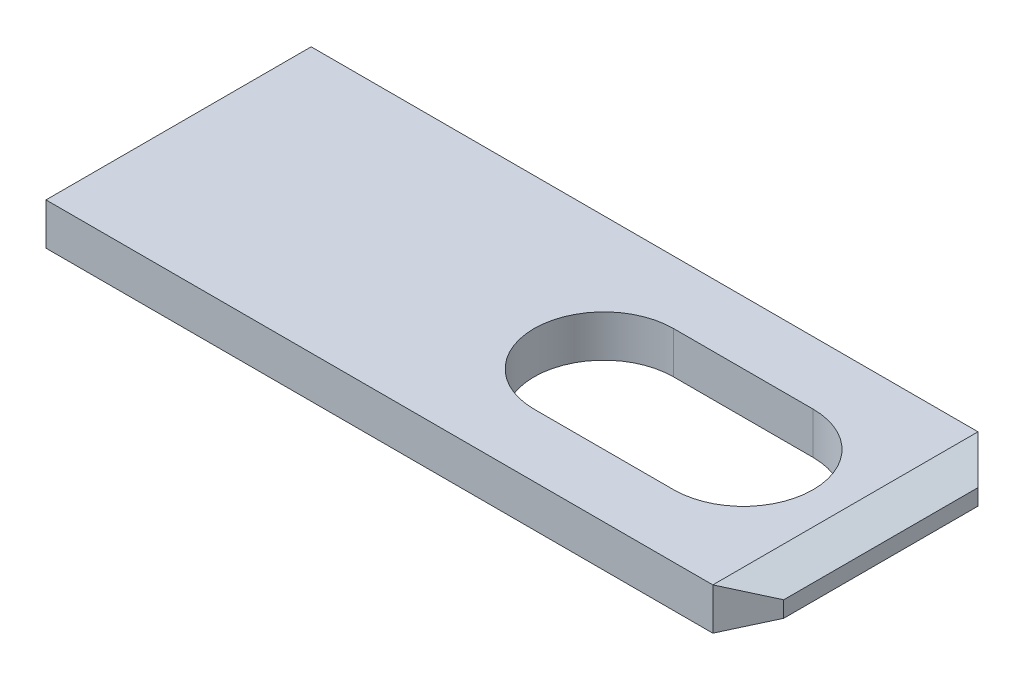
ISO-10303-21;
HEADER;
FILE_DESCRIPTION(('STEP AP214'),'2;1');
FILE_NAME('part.step','',(''),(''),'','','');
FILE_SCHEMA(('AUTOMOTIVE_DESIGN { 1 0 10303 214 1 1 1 1 }'));
ENDSEC;
DATA;
#1=APPLICATION_CONTEXT('core data for automotive mechanical design processes');
#2=APPLICATION_PROTOCOL_DEFINITION('international standard','automotive_design',2000,#1);
#3=PRODUCT_CONTEXT('',#1,'mechanical');
#4=PRODUCT('Part','Part','',(#3));
#5=PRODUCT_RELATED_PRODUCT_CATEGORY('part','',(#4));
#6=PRODUCT_DEFINITION_FORMATION('','',#4);
#7=PRODUCT_DEFINITION_CONTEXT('part definition',#1,'design');
#8=PRODUCT_DEFINITION('design','',#6,#7);
#9=PRODUCT_DEFINITION_SHAPE('','',#8);
#10=(LENGTH_UNIT() NAMED_UNIT(*) SI_UNIT(.MILLI.,.METRE.));
#11=(NAMED_UNIT(*) PLANE_ANGLE_UNIT() SI_UNIT($,.RADIAN.));
#12=(NAMED_UNIT(*) SI_UNIT($,.STERADIAN.) SOLID_ANGLE_UNIT());
#13=UNCERTAINTY_MEASURE_WITH_UNIT(LENGTH_MEASURE(1.E-05),#10,'distance_accuracy_value','');
#14=(GEOMETRIC_REPRESENTATION_CONTEXT(3) GLOBAL_UNCERTAINTY_ASSIGNED_CONTEXT((#13)) GLOBAL_UNIT_ASSIGNED_CONTEXT((#10,
#11,#12)) REPRESENTATION_CONTEXT('',''));
#15=CARTESIAN_POINT('',(0.,0.,0.));
#16=DIRECTION('',(0.,0.,1.));
#17=DIRECTION('',(1.,0.,0.));
#18=AXIS2_PLACEMENT_3D('',#15,#16,#17);
#19=CARTESIAN_POINT('',(10.063988,-0.115103120992769,1.89999999999998));
#20=DIRECTION('',(0.342020143325666,-0.939692620785909,0.));
#21=DIRECTION('',(0.939692620785909,0.342020143325666,0.));
#22=AXIS2_PLACEMENT_3D('',#19,#20,#21);
#23=PLANE('',#22);
#24=DIRECTION('',(0.684791078771737,0.249243569363954,-0.684791078771735));
#25=VECTOR('',#24,1.);
#26=CARTESIAN_POINT('',(9.555988,-0.3,1.89999999999999));
#27=LINE('',#26,#25);
#28=CARTESIAN_POINT('',(9.555988,-0.3,1.89999999999999));
#29=VERTEX_POINT('',#28);
#30=CARTESIAN_POINT('',(10.063988,-0.115103120992769,1.39199999999999));
#31=VERTEX_POINT('',#30);
#32=EDGE_CURVE('E100',#29,#31,#27,.T.);
#33=ORIENTED_EDGE('',*,*,#32,.F.);
#34=DIRECTION('',(0.,0.,1.));
#35=VECTOR('',#34,1.);
#36=CARTESIAN_POINT('',(9.555988,-0.3,-1.90000000000001));
#37=LINE('',#36,#35);
#38=CARTESIAN_POINT('',(9.555988,-0.3,-1.90000000000001));
#39=VERTEX_POINT('',#38);
#40=EDGE_CURVE('E162',#29,#39,#37,.F.);
#41=ORIENTED_EDGE('',*,*,#40,.T.);
#42=DIRECTION('',(-0.684791078771737,-0.249243569363953,-0.684791078771735));
#43=VECTOR('',#42,1.);
#44=CARTESIAN_POINT('',(10.063988,-0.115103120992769,-1.39200000000001));
#45=LINE('',#44,#43);
#46=CARTESIAN_POINT('',(10.063988,-0.115103120992769,-1.39200000000001));
#47=VERTEX_POINT('',#46);
#48=EDGE_CURVE('E112',#47,#39,#45,.T.);
#49=ORIENTED_EDGE('',*,*,#48,.F.);
#50=DIRECTION('',(0.,0.,-1.));
#51=VECTOR('',#50,1.);
#52=CARTESIAN_POINT('',(10.063988,-0.115103120992769,1.89999999999998));
#53=LINE('',#52,#51);
#54=EDGE_CURVE('E93',#31,#47,#53,.T.);
#55=ORIENTED_EDGE('',*,*,#54,.F.);
#56=EDGE_LOOP('',(#33,#41,#49,#55));
#57=FACE_BOUND('',#56,.T.);
#58=ADVANCED_FACE('F17',(#57),#23,.T.);
#59=CARTESIAN_POINT('',(10.063988,0.299999999999999,1.39199999999999));
#60=DIRECTION('',(0.707106781186546,0.,0.707106781186549));
#61=DIRECTION('',(0.707106781186549,0.,-0.707106781186546));
#62=AXIS2_PLACEMENT_3D('',#59,#60,#61);
#63=PLANE('',#62);
#64=DIRECTION('',(0.,1.,0.));
#65=VECTOR('',#64,1.);
#66=CARTESIAN_POINT('',(9.555988,-0.3,1.89999999999998));
#67=LINE('',#66,#65);
#68=CARTESIAN_POINT('',(9.555988,0.299999999999999,1.89999999999999));
#69=VERTEX_POINT('',#68);
#70=EDGE_CURVE('E105',#69,#29,#67,.F.);
#71=ORIENTED_EDGE('',*,*,#70,.T.);
#72=ORIENTED_EDGE('',*,*,#32,.T.);
#73=DIRECTION('',(0.,1.,0.));
#74=VECTOR('',#73,1.);
#75=CARTESIAN_POINT('',(10.063988,0.299999999999999,1.39199999999999));
#76=LINE('',#75,#74);
#77=CARTESIAN_POINT('',(10.063988,0.115103120992769,1.39199999999999));
#78=VERTEX_POINT('',#77);
#79=EDGE_CURVE('E103',#78,#31,#76,.F.);
#80=ORIENTED_EDGE('',*,*,#79,.F.);
#81=DIRECTION('',(0.684791078771738,-0.249243569363953,-0.684791078771734));
#82=VECTOR('',#81,1.);
#83=CARTESIAN_POINT('',(9.555988,0.299999999999999,1.89999999999999));
#84=LINE('',#83,#82);
#85=EDGE_CURVE('E143',#69,#78,#84,.T.);
#86=ORIENTED_EDGE('',*,*,#85,.F.);
#87=EDGE_LOOP('',(#71,#72,#80,#86));
#88=FACE_BOUND('',#87,.T.);
#89=ADVANCED_FACE('F101',(#88),#63,.T.);
#90=CARTESIAN_POINT('',(10.063988,0.299999999999999,1.89999999999998));
#91=DIRECTION('',(1.,0.,0.));
#92=DIRECTION('',(0.,0.,-1.));
#93=AXIS2_PLACEMENT_3D('',#90,#91,#92);
#94=PLANE('',#93);
#95=ORIENTED_EDGE('',*,*,#79,.T.);
#96=ORIENTED_EDGE('',*,*,#54,.T.);
#97=DIRECTION('',(0.,1.,0.));
#98=VECTOR('',#97,1.);
#99=CARTESIAN_POINT('',(10.063988,0.299999999999999,-1.39200000000001));
#100=LINE('',#99,#98);
#101=CARTESIAN_POINT('',(10.063988,0.115103120992769,-1.39200000000001));
#102=VERTEX_POINT('',#101);
#103=EDGE_CURVE('E113',#102,#47,#100,.F.);
#104=ORIENTED_EDGE('',*,*,#103,.F.);
#105=DIRECTION('',(0.,0.,1.));
#106=VECTOR('',#105,1.);
#107=CARTESIAN_POINT('',(10.063988,0.115103120992768,1.89999999999998));
#108=LINE('',#107,#106);
#109=EDGE_CURVE('E70',#78,#102,#108,.F.);
#110=ORIENTED_EDGE('',*,*,#109,.F.);
#111=EDGE_LOOP('',(#95,#96,#104,#110));
#112=FACE_BOUND('',#111,.T.);
#113=ADVANCED_FACE('F109',(#112),#94,.T.);
#114=CARTESIAN_POINT('',(10.063988,0.299999999999999,-1.39200000000001));
#115=DIRECTION('',(0.707106781186546,0.,-0.707106781186549));
#116=DIRECTION('',(-0.707106781186549,0.,-0.707106781186546));
#117=AXIS2_PLACEMENT_3D('',#114,#115,#116);
#118=PLANE('',#117);
#119=ORIENTED_EDGE('',*,*,#103,.T.);
#120=ORIENTED_EDGE('',*,*,#48,.T.);
#121=DIRECTION('',(0.,1.,0.));
#122=VECTOR('',#121,1.);
#123=CARTESIAN_POINT('',(9.555988,-0.3,-1.90000000000001));
#124=LINE('',#123,#122);
#125=CARTESIAN_POINT('',(9.555988,0.3,-1.90000000000001));
#126=VERTEX_POINT('',#125);
#127=EDGE_CURVE('E145',#39,#126,#124,.T.);
#128=ORIENTED_EDGE('',*,*,#127,.T.);
#129=DIRECTION('',(-0.684791078771738,0.249243569363953,-0.684791078771734));
#130=VECTOR('',#129,1.);
#131=CARTESIAN_POINT('',(10.063988,0.115103120992769,-1.39200000000001));
#132=LINE('',#131,#130);
#133=EDGE_CURVE('E140',#102,#126,#132,.T.);
#134=ORIENTED_EDGE('',*,*,#133,.F.);
#135=EDGE_LOOP('',(#119,#120,#128,#134));
#136=FACE_BOUND('',#135,.T.);
#137=ADVANCED_FACE('F165',(#136),#118,.T.);
#138=CARTESIAN_POINT('',(10.063988,-0.3,-1.90000000000001));
#139=DIRECTION('',(0.,1.,0.));
#140=DIRECTION('',(0.,0.,1.));
#141=AXIS2_PLACEMENT_3D('',#138,#139,#140);
#142=PLANE('',#141);
#143=DIRECTION('',(1.,0.,0.));
#144=VECTOR('',#143,1.);
#145=CARTESIAN_POINT('',(8.09373158605447,-0.300000000000001,1.));
#146=LINE('',#145,#144);
#147=CARTESIAN_POINT('',(6.09373158605447,-0.300000000000001,1.));
#148=VERTEX_POINT('',#147);
#149=CARTESIAN_POINT('',(8.09373158605447,-0.300000000000001,1.));
#150=VERTEX_POINT('',#149);
#151=EDGE_CURVE('E61',#148,#150,#146,.T.);
#152=ORIENTED_EDGE('',*,*,#151,.T.);
#153=CARTESIAN_POINT('',(8.09373158605447,-0.3,0.));
#154=DIRECTION('',(0.,1.,0.));
#155=DIRECTION('',(0.,0.,1.));
#156=AXIS2_PLACEMENT_3D('',#153,#154,#155);
#157=CIRCLE('',#156,1.);
#158=CARTESIAN_POINT('',(8.09373158605447,-0.3,-1.));
#159=VERTEX_POINT('',#158);
#160=EDGE_CURVE('E20',#150,#159,#157,.T.);
#161=ORIENTED_EDGE('',*,*,#160,.T.);
#162=DIRECTION('',(1.,0.,0.));
#163=VECTOR('',#162,1.);
#164=CARTESIAN_POINT('',(6.09373158605447,-0.3,-1.));
#165=LINE('',#164,#163);
#166=CARTESIAN_POINT('',(6.09373158605447,-0.3,-1.));
#167=VERTEX_POINT('',#166);
#168=EDGE_CURVE('E126',#159,#167,#165,.F.);
#169=ORIENTED_EDGE('',*,*,#168,.T.);
#170=CARTESIAN_POINT('',(6.09373158605447,-0.300000000000001,0.));
#171=DIRECTION('',(0.,1.,0.));
#172=DIRECTION('',(0.,0.,1.));
#173=AXIS2_PLACEMENT_3D('',#170,#171,#172);
#174=CIRCLE('',#173,1.);
#175=EDGE_CURVE('E121',#167,#148,#174,.T.);
#176=ORIENTED_EDGE('',*,*,#175,.T.);
#177=EDGE_LOOP('',(#152,#161,#169,#176));
#178=FACE_BOUND('',#177,.T.);
#179=DIRECTION('',(-1.,0.,0.));
#180=VECTOR('',#179,1.);
#181=CARTESIAN_POINT('',(10.063988,-0.3,1.89999999999998));
#182=LINE('',#181,#180);
#183=CARTESIAN_POINT('',(0.,-0.3,1.89999999999999));
#184=VERTEX_POINT('',#183);
#185=EDGE_CURVE('E160',#29,#184,#182,.T.);
#186=ORIENTED_EDGE('',*,*,#185,.T.);
#187=DIRECTION('',(0.,0.,-1.));
#188=VECTOR('',#187,1.);
#189=CARTESIAN_POINT('',(0.,-0.300000000000001,1.89999999999998));
#190=LINE('',#189,#188);
#191=CARTESIAN_POINT('',(0.,-0.3,-1.90000000000001));
#192=VERTEX_POINT('',#191);
#193=EDGE_CURVE('E154',#184,#192,#190,.T.);
#194=ORIENTED_EDGE('',*,*,#193,.T.);
#195=DIRECTION('',(1.,0.,0.));
#196=VECTOR('',#195,1.);
#197=CARTESIAN_POINT('',(10.063988,-0.3,-1.90000000000001));
#198=LINE('',#197,#196);
#199=EDGE_CURVE('E148',#192,#39,#198,.T.);
#200=ORIENTED_EDGE('',*,*,#199,.T.);
#201=ORIENTED_EDGE('',*,*,#40,.F.);
#202=EDGE_LOOP('',(#186,#194,#200,#201));
#203=FACE_BOUND('',#202,.T.);
#204=ADVANCED_FACE('F178',(#178,#203),#142,.F.);
#205=CARTESIAN_POINT('',(10.063988,-0.3,1.89999999999998));
#206=DIRECTION('',(0.,0.,-1.));
#207=DIRECTION('',(-1.,0.,0.));
#208=AXIS2_PLACEMENT_3D('',#205,#206,#207);
#209=PLANE('',#208);
#210=DIRECTION('',(1.,0.,0.));
#211=VECTOR('',#210,1.);
#212=CARTESIAN_POINT('',(10.063988,0.299999999999999,1.89999999999999));
#213=LINE('',#212,#211);
#214=CARTESIAN_POINT('',(0.,0.3,1.89999999999999));
#215=VERTEX_POINT('',#214);
#216=EDGE_CURVE('E124',#69,#215,#213,.F.);
#217=ORIENTED_EDGE('',*,*,#216,.T.);
#218=DIRECTION('',(0.,1.,0.));
#219=VECTOR('',#218,1.);
#220=CARTESIAN_POINT('',(0.,0.299999999999999,1.89999999999999));
#221=LINE('',#220,#219);
#222=EDGE_CURVE('E156',#215,#184,#221,.F.);
#223=ORIENTED_EDGE('',*,*,#222,.T.);
#224=ORIENTED_EDGE('',*,*,#185,.F.);
#225=ORIENTED_EDGE('',*,*,#70,.F.);
#226=EDGE_LOOP('',(#217,#223,#224,#225));
#227=FACE_BOUND('',#226,.T.);
#228=ADVANCED_FACE('F187',(#227),#209,.F.);
#229=CARTESIAN_POINT('',(0.,0.299999999999999,1.89999999999998));
#230=DIRECTION('',(1.,0.,0.));
#231=DIRECTION('',(0.,0.,-1.));
#232=AXIS2_PLACEMENT_3D('',#229,#230,#231);
#233=PLANE('',#232);
#234=DIRECTION('',(0.,1.,0.));
#235=VECTOR('',#234,1.);
#236=CARTESIAN_POINT('',(0.,-0.3,-1.90000000000001));
#237=LINE('',#236,#235);
#238=CARTESIAN_POINT('',(0.,0.3,-1.90000000000001));
#239=VERTEX_POINT('',#238);
#240=EDGE_CURVE('E151',#239,#192,#237,.F.);
#241=ORIENTED_EDGE('',*,*,#240,.T.);
#242=ORIENTED_EDGE('',*,*,#193,.F.);
#243=ORIENTED_EDGE('',*,*,#222,.F.);
#244=DIRECTION('',(0.,0.,-1.));
#245=VECTOR('',#244,1.);
#246=CARTESIAN_POINT('',(0.,0.3,-1.90000000000001));
#247=LINE('',#246,#245);
#248=EDGE_CURVE('E191',#215,#239,#247,.T.);
#249=ORIENTED_EDGE('',*,*,#248,.T.);
#250=EDGE_LOOP('',(#241,#242,#243,#249));
#251=FACE_BOUND('',#250,.T.);
#252=ADVANCED_FACE('F182',(#251),#233,.F.);
#253=CARTESIAN_POINT('',(10.063988,-0.3,-1.90000000000001));
#254=DIRECTION('',(0.,0.,1.));
#255=DIRECTION('',(1.,0.,0.));
#256=AXIS2_PLACEMENT_3D('',#253,#254,#255);
#257=PLANE('',#256);
#258=ORIENTED_EDGE('',*,*,#199,.F.);
#259=ORIENTED_EDGE('',*,*,#240,.F.);
#260=DIRECTION('',(1.,0.,0.));
#261=VECTOR('',#260,1.);
#262=CARTESIAN_POINT('',(10.063988,0.3,-1.90000000000001));
#263=LINE('',#262,#261);
#264=EDGE_CURVE('E177',#239,#126,#263,.T.);
#265=ORIENTED_EDGE('',*,*,#264,.T.);
#266=ORIENTED_EDGE('',*,*,#127,.F.);
#267=EDGE_LOOP('',(#258,#259,#265,#266));
#268=FACE_BOUND('',#267,.T.);
#269=ADVANCED_FACE('F174',(#268),#257,.F.);
#270=CARTESIAN_POINT('',(10.063988,0.115103120992768,1.89999999999998));
#271=DIRECTION('',(0.342020143325666,0.939692620785909,0.));
#272=DIRECTION('',(-0.939692620785909,0.342020143325666,0.));
#273=AXIS2_PLACEMENT_3D('',#270,#271,#272);
#274=PLANE('',#273);
#275=ORIENTED_EDGE('',*,*,#133,.T.);
#276=DIRECTION('',(0.,0.,-1.));
#277=VECTOR('',#276,1.);
#278=CARTESIAN_POINT('',(9.555988,0.3,-1.90000000000001));
#279=LINE('',#278,#277);
#280=EDGE_CURVE('E195',#126,#69,#279,.F.);
#281=ORIENTED_EDGE('',*,*,#280,.T.);
#282=ORIENTED_EDGE('',*,*,#85,.T.);
#283=ORIENTED_EDGE('',*,*,#109,.T.);
#284=EDGE_LOOP('',(#275,#281,#282,#283));
#285=FACE_BOUND('',#284,.T.);
#286=ADVANCED_FACE('F225',(#285),#274,.T.);
#287=CARTESIAN_POINT('',(8.09373158605447,-0.300000000000001,1.));
#288=DIRECTION('',(0.,0.,1.));
#289=DIRECTION('',(0.,-1.,0.));
#290=AXIS2_PLACEMENT_3D('',#287,#288,#289);
#291=PLANE('',#290);
#292=ORIENTED_EDGE('',*,*,#151,.F.);
#293=DIRECTION('',(0.,1.,0.));
#294=VECTOR('',#293,1.);
#295=CARTESIAN_POINT('',(6.09373158605447,-0.300000000000001,1.));
#296=LINE('',#295,#294);
#297=CARTESIAN_POINT('',(6.09373158605447,0.3,1.));
#298=VERTEX_POINT('',#297);
#299=EDGE_CURVE('E122',#148,#298,#296,.T.);
#300=ORIENTED_EDGE('',*,*,#299,.T.);
#301=DIRECTION('',(1.,0.,0.));
#302=VECTOR('',#301,1.);
#303=CARTESIAN_POINT('',(10.063988,0.3,1.));
#304=LINE('',#303,#302);
#305=CARTESIAN_POINT('',(8.09373158605447,0.3,1.));
#306=VERTEX_POINT('',#305);
#307=EDGE_CURVE('E120',#298,#306,#304,.T.);
#308=ORIENTED_EDGE('',*,*,#307,.T.);
#309=DIRECTION('',(0.,1.,0.));
#310=VECTOR('',#309,1.);
#311=CARTESIAN_POINT('',(8.09373158605447,-0.300000000000001,1.));
#312=LINE('',#311,#310);
#313=EDGE_CURVE('E137',#306,#150,#312,.F.);
#314=ORIENTED_EDGE('',*,*,#313,.T.);
#315=EDGE_LOOP('',(#292,#300,#308,#314));
#316=FACE_BOUND('',#315,.T.);
#317=ADVANCED_FACE('F208',(#316),#291,.F.);
#318=CARTESIAN_POINT('',(8.09373158605447,-0.300000000000001,0.));
#319=DIRECTION('',(0.,1.,0.));
#320=DIRECTION('',(0.,0.,1.));
#321=AXIS2_PLACEMENT_3D('',#318,#319,#320);
#322=CYLINDRICAL_SURFACE('',#321,1.);
#323=ORIENTED_EDGE('',*,*,#160,.F.);
#324=ORIENTED_EDGE('',*,*,#313,.F.);
#325=CARTESIAN_POINT('',(8.09373158605447,0.3,0.));
#326=DIRECTION('',(0.,1.,0.));
#327=DIRECTION('',(0.,0.,1.));
#328=AXIS2_PLACEMENT_3D('',#325,#326,#327);
#329=CIRCLE('',#328,1.);
#330=CARTESIAN_POINT('',(8.09373158605447,0.3,-1.));
#331=VERTEX_POINT('',#330);
#332=EDGE_CURVE('E118',#306,#331,#329,.T.);
#333=ORIENTED_EDGE('',*,*,#332,.T.);
#334=DIRECTION('',(0.,1.,0.));
#335=VECTOR('',#334,1.);
#336=CARTESIAN_POINT('',(8.09373158605447,-0.300000000000001,-1.));
#337=LINE('',#336,#335);
#338=EDGE_CURVE('E131',#331,#159,#337,.F.);
#339=ORIENTED_EDGE('',*,*,#338,.T.);
#340=EDGE_LOOP('',(#323,#324,#333,#339));
#341=FACE_BOUND('',#340,.T.);
#342=ADVANCED_FACE('F206',(#341),#322,.F.);
#343=CARTESIAN_POINT('',(6.09373158605447,-0.300000000000001,-1.));
#344=DIRECTION('',(0.,0.,-1.));
#345=DIRECTION('',(0.,1.,0.));
#346=AXIS2_PLACEMENT_3D('',#343,#344,#345);
#347=PLANE('',#346);
#348=ORIENTED_EDGE('',*,*,#168,.F.);
#349=ORIENTED_EDGE('',*,*,#338,.F.);
#350=DIRECTION('',(1.,0.,0.));
#351=VECTOR('',#350,1.);
#352=CARTESIAN_POINT('',(10.063988,0.3,-1.));
#353=LINE('',#352,#351);
#354=CARTESIAN_POINT('',(6.09373158605447,0.3,-1.));
#355=VERTEX_POINT('',#354);
#356=EDGE_CURVE('E26',#331,#355,#353,.F.);
#357=ORIENTED_EDGE('',*,*,#356,.T.);
#358=DIRECTION('',(0.,1.,0.));
#359=VECTOR('',#358,1.);
#360=CARTESIAN_POINT('',(6.09373158605447,-0.300000000000001,-1.));
#361=LINE('',#360,#359);
#362=EDGE_CURVE('E34',#355,#167,#361,.F.);
#363=ORIENTED_EDGE('',*,*,#362,.T.);
#364=EDGE_LOOP('',(#348,#349,#357,#363));
#365=FACE_BOUND('',#364,.T.);
#366=ADVANCED_FACE('F201',(#365),#347,.F.);
#367=CARTESIAN_POINT('',(6.09373158605447,-0.300000000000001,0.));
#368=DIRECTION('',(0.,1.,0.));
#369=DIRECTION('',(0.,0.,1.));
#370=AXIS2_PLACEMENT_3D('',#367,#368,#369);
#371=CYLINDRICAL_SURFACE('',#370,1.);
#372=ORIENTED_EDGE('',*,*,#175,.F.);
#373=ORIENTED_EDGE('',*,*,#362,.F.);
#374=CARTESIAN_POINT('',(6.09373158605447,0.3,0.));
#375=DIRECTION('',(0.,1.,0.));
#376=DIRECTION('',(0.,0.,1.));
#377=AXIS2_PLACEMENT_3D('',#374,#375,#376);
#378=CIRCLE('',#377,1.);
#379=EDGE_CURVE('E11',#355,#298,#378,.T.);
#380=ORIENTED_EDGE('',*,*,#379,.T.);
#381=ORIENTED_EDGE('',*,*,#299,.F.);
#382=EDGE_LOOP('',(#372,#373,#380,#381));
#383=FACE_BOUND('',#382,.T.);
#384=ADVANCED_FACE('F210',(#383),#371,.F.);
#385=CARTESIAN_POINT('',(10.063988,0.3,-1.90000000000001));
#386=DIRECTION('',(0.,-1.,0.));
#387=DIRECTION('',(0.,0.,-1.));
#388=AXIS2_PLACEMENT_3D('',#385,#386,#387);
#389=PLANE('',#388);
#390=ORIENTED_EDGE('',*,*,#356,.F.);
#391=ORIENTED_EDGE('',*,*,#332,.F.);
#392=ORIENTED_EDGE('',*,*,#307,.F.);
#393=ORIENTED_EDGE('',*,*,#379,.F.);
#394=EDGE_LOOP('',(#390,#391,#392,#393));
#395=FACE_BOUND('',#394,.T.);
#396=ORIENTED_EDGE('',*,*,#264,.F.);
#397=ORIENTED_EDGE('',*,*,#248,.F.);
#398=ORIENTED_EDGE('',*,*,#216,.F.);
#399=ORIENTED_EDGE('',*,*,#280,.F.);
#400=EDGE_LOOP('',(#396,#397,#398,#399));
#401=FACE_BOUND('',#400,.T.);
#402=ADVANCED_FACE('F204',(#395,#401),#389,.F.);
#403=CLOSED_SHELL('',(#58,#89,#113,#137,#204,#228,#252,#269,#286,#317,#342,#366,#384,#402));
#404=MANIFOLD_SOLID_BREP('B1',#403);
#405=ADVANCED_BREP_SHAPE_REPRESENTATION('',(#18,#404),#14);
#406=SHAPE_DEFINITION_REPRESENTATION(#9,#405);
ENDSEC;
END-ISO-10303-21;
